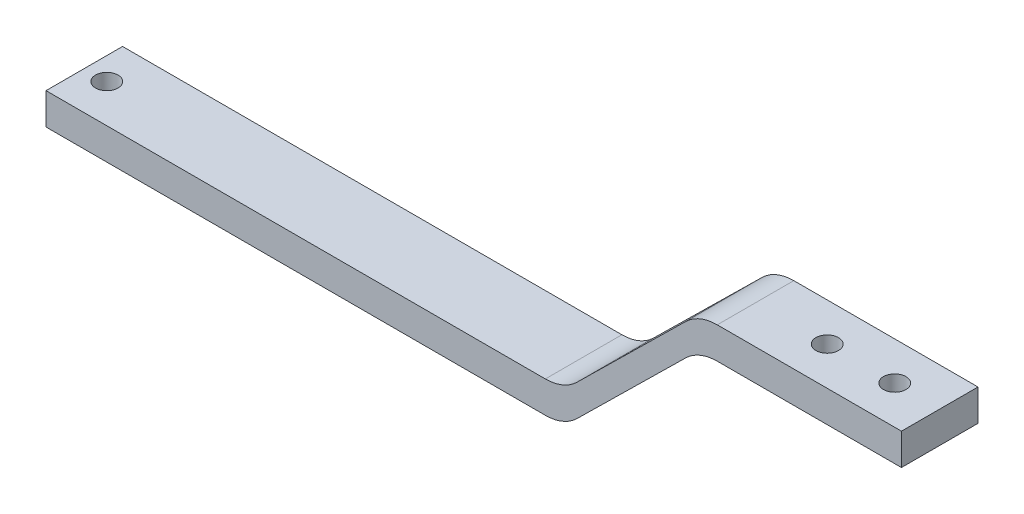
ISO-10303-21;
HEADER;
FILE_DESCRIPTION(('STEP AP214'),'2;1');
FILE_NAME('part.step','',(''),(''),'','','');
FILE_SCHEMA(('AUTOMOTIVE_DESIGN { 1 0 10303 214 1 1 1 1 }'));
ENDSEC;
DATA;
#1=APPLICATION_CONTEXT('core data for automotive mechanical design processes');
#2=APPLICATION_PROTOCOL_DEFINITION('international standard','automotive_design',2000,#1);
#3=PRODUCT_CONTEXT('',#1,'mechanical');
#4=PRODUCT('Part','Part','',(#3));
#5=PRODUCT_RELATED_PRODUCT_CATEGORY('part','',(#4));
#6=PRODUCT_DEFINITION_FORMATION('','',#4);
#7=PRODUCT_DEFINITION_CONTEXT('part definition',#1,'design');
#8=PRODUCT_DEFINITION('design','',#6,#7);
#9=PRODUCT_DEFINITION_SHAPE('','',#8);
#10=(LENGTH_UNIT() NAMED_UNIT(*) SI_UNIT(.MILLI.,.METRE.));
#11=(NAMED_UNIT(*) PLANE_ANGLE_UNIT() SI_UNIT($,.RADIAN.));
#12=(NAMED_UNIT(*) SI_UNIT($,.STERADIAN.) SOLID_ANGLE_UNIT());
#13=UNCERTAINTY_MEASURE_WITH_UNIT(LENGTH_MEASURE(1.E-05),#10,'distance_accuracy_value','');
#14=(GEOMETRIC_REPRESENTATION_CONTEXT(3) GLOBAL_UNCERTAINTY_ASSIGNED_CONTEXT((#13)) GLOBAL_UNIT_ASSIGNED_CONTEXT((#10,
#11,#12)) REPRESENTATION_CONTEXT('',''));
#15=CARTESIAN_POINT('',(0.,0.,0.));
#16=DIRECTION('',(0.,0.,1.));
#17=DIRECTION('',(1.,0.,0.));
#18=AXIS2_PLACEMENT_3D('',#15,#16,#17);
#19=CARTESIAN_POINT('',(-135.932508130997,25.1332184968222,17.));
#20=DIRECTION('',(1.,0.,0.));
#21=DIRECTION('',(0.,0.,-1.));
#22=AXIS2_PLACEMENT_3D('',#19,#20,#21);
#23=PLANE('',#22);
#24=DIRECTION('',(0.,-1.,0.));
#25=VECTOR('',#24,1.);
#26=CARTESIAN_POINT('',(-135.932508130997,25.1332184968222,0.));
#27=LINE('',#26,#25);
#28=CARTESIAN_POINT('',(-135.932508130997,32.1332184968221,0.));
#29=VERTEX_POINT('',#28);
#30=CARTESIAN_POINT('',(-135.932508130997,25.1332184968222,0.));
#31=VERTEX_POINT('',#30);
#32=EDGE_CURVE('E140',#29,#31,#27,.T.);
#33=ORIENTED_EDGE('',*,*,#32,.T.);
#34=DIRECTION('',(0.,0.,-1.));
#35=VECTOR('',#34,1.);
#36=CARTESIAN_POINT('',(-135.932508130997,25.1332184968222,17.));
#37=LINE('',#36,#35);
#38=CARTESIAN_POINT('',(-135.932508130997,25.1332184968222,17.));
#39=VERTEX_POINT('',#38);
#40=EDGE_CURVE('E124',#39,#31,#37,.T.);
#41=ORIENTED_EDGE('',*,*,#40,.F.);
#42=DIRECTION('',(0.,-1.,0.));
#43=VECTOR('',#42,1.);
#44=CARTESIAN_POINT('',(-135.932508130997,25.1332184968222,17.));
#45=LINE('',#44,#43);
#46=CARTESIAN_POINT('',(-135.932508130997,32.1332184968221,17.));
#47=VERTEX_POINT('',#46);
#48=EDGE_CURVE('E128',#47,#39,#45,.T.);
#49=ORIENTED_EDGE('',*,*,#48,.F.);
#50=DIRECTION('',(0.,0.,-1.));
#51=VECTOR('',#50,1.);
#52=CARTESIAN_POINT('',(-135.932508130997,32.1332184968221,17.));
#53=LINE('',#52,#51);
#54=EDGE_CURVE('E209',#47,#29,#53,.T.);
#55=ORIENTED_EDGE('',*,*,#54,.T.);
#56=EDGE_LOOP('',(#33,#41,#49,#55));
#57=FACE_BOUND('',#56,.T.);
#58=ADVANCED_FACE('F31',(#57),#23,.F.);
#59=CARTESIAN_POINT('',(-20.9325081309967,25.1332184968222,17.));
#60=DIRECTION('',(0.,1.,0.));
#61=DIRECTION('',(0.,0.,1.));
#62=AXIS2_PLACEMENT_3D('',#59,#60,#61);
#63=PLANE('',#62);
#64=CARTESIAN_POINT('',(-130.932508130997,25.1332184968222,8.5));
#65=DIRECTION('',(0.,-1.,0.));
#66=DIRECTION('',(0.,0.,-1.));
#67=AXIS2_PLACEMENT_3D('',#64,#65,#66);
#68=CIRCLE('',#67,2.5);
#69=CARTESIAN_POINT('',(-130.932508130997,25.1332184968222,6.00000000000001));
#70=VERTEX_POINT('',#69);
#71=EDGE_CURVE('E195',#70,#70,#68,.T.);
#72=ORIENTED_EDGE('',*,*,#71,.F.);
#73=EDGE_LOOP('',(#72));
#74=FACE_BOUND('',#73,.T.);
#75=DIRECTION('',(1.,0.,0.));
#76=VECTOR('',#75,1.);
#77=CARTESIAN_POINT('',(-20.9325081309967,25.1332184968222,0.));
#78=LINE('',#77,#76);
#79=CARTESIAN_POINT('',(-25.0255043929706,25.1332184968222,0.));
#80=VERTEX_POINT('',#79);
#81=EDGE_CURVE('E211',#31,#80,#78,.T.);
#82=ORIENTED_EDGE('',*,*,#81,.T.);
#83=DIRECTION('',(0.,0.,-1.));
#84=VECTOR('',#83,1.);
#85=CARTESIAN_POINT('',(-25.0255043929706,25.1332184968222,17.));
#86=LINE('',#85,#84);
#87=CARTESIAN_POINT('',(-25.0255043929706,25.1332184968222,17.));
#88=VERTEX_POINT('',#87);
#89=EDGE_CURVE('E54',#80,#88,#86,.F.);
#90=ORIENTED_EDGE('',*,*,#89,.T.);
#91=DIRECTION('',(1.,0.,0.));
#92=VECTOR('',#91,1.);
#93=CARTESIAN_POINT('',(-20.9325081309967,25.1332184968222,17.));
#94=LINE('',#93,#92);
#95=EDGE_CURVE('E120',#39,#88,#94,.T.);
#96=ORIENTED_EDGE('',*,*,#95,.F.);
#97=ORIENTED_EDGE('',*,*,#40,.T.);
#98=EDGE_LOOP('',(#82,#90,#96,#97));
#99=FACE_BOUND('',#98,.T.);
#100=ADVANCED_FACE('F122',(#74,#99),#63,.F.);
#101=CARTESIAN_POINT('',(9.06749186900328,54.6332184968222,17.));
#102=DIRECTION('',(-0.701139951813741,0.713023679810583,0.));
#103=DIRECTION('',(-0.713023679810583,-0.701139951813741,0.));
#104=AXIS2_PLACEMENT_3D('',#101,#102,#103);
#105=PLANE('',#104);
#106=DIRECTION('',(0.713023679810583,0.701139951813741,0.));
#107=VECTOR('',#106,1.);
#108=CARTESIAN_POINT('',(9.06749186900328,54.6332184968222,0.));
#109=LINE('',#108,#107);
#110=CARTESIAN_POINT('',(-18.0141048748332,28.0029816987163,0.));
#111=VERTEX_POINT('',#110);
#112=CARTESIAN_POINT('',(6.14908861283972,51.763455294928,0.));
#113=VERTEX_POINT('',#112);
#114=EDGE_CURVE('E213',#111,#113,#109,.T.);
#115=ORIENTED_EDGE('',*,*,#114,.T.);
#116=DIRECTION('',(0.,0.,-1.));
#117=VECTOR('',#116,1.);
#118=CARTESIAN_POINT('',(6.14908861283972,51.763455294928,17.));
#119=LINE('',#118,#117);
#120=CARTESIAN_POINT('',(6.14908861283972,51.763455294928,17.));
#121=VERTEX_POINT('',#120);
#122=EDGE_CURVE('E154',#113,#121,#119,.F.);
#123=ORIENTED_EDGE('',*,*,#122,.T.);
#124=DIRECTION('',(0.713023679810583,0.701139951813741,0.));
#125=VECTOR('',#124,1.);
#126=CARTESIAN_POINT('',(9.06749186900328,54.6332184968222,17.));
#127=LINE('',#126,#125);
#128=CARTESIAN_POINT('',(-18.0141048748332,28.0029816987163,17.));
#129=VERTEX_POINT('',#128);
#130=EDGE_CURVE('E127',#129,#121,#127,.T.);
#131=ORIENTED_EDGE('',*,*,#130,.F.);
#132=DIRECTION('',(0.,0.,-1.));
#133=VECTOR('',#132,1.);
#134=CARTESIAN_POINT('',(-18.0141048748332,28.0029816987163,17.));
#135=LINE('',#134,#133);
#136=EDGE_CURVE('E145',#129,#111,#135,.T.);
#137=ORIENTED_EDGE('',*,*,#136,.T.);
#138=EDGE_LOOP('',(#115,#123,#131,#137));
#139=FACE_BOUND('',#138,.T.);
#140=ADVANCED_FACE('F261',(#139),#105,.F.);
#141=CARTESIAN_POINT('',(54.0674918690033,54.6332184968222,17.));
#142=DIRECTION('',(0.,1.,0.));
#143=DIRECTION('',(-1.,0.,0.));
#144=AXIS2_PLACEMENT_3D('',#141,#142,#143);
#145=PLANE('',#144);
#146=CARTESIAN_POINT('',(29.0674918690033,54.6332184968222,8.5));
#147=DIRECTION('',(0.,-1.,0.));
#148=DIRECTION('',(1.,0.,0.));
#149=AXIS2_PLACEMENT_3D('',#146,#147,#148);
#150=CIRCLE('',#149,2.49999999999999);
#151=CARTESIAN_POINT('',(31.5674918690033,54.6332184968222,8.5));
#152=VERTEX_POINT('',#151);
#153=EDGE_CURVE('E185',#152,#152,#150,.T.);
#154=ORIENTED_EDGE('',*,*,#153,.F.);
#155=EDGE_LOOP('',(#154));
#156=FACE_BOUND('',#155,.T.);
#157=CARTESIAN_POINT('',(44.0674918690033,54.6332184968222,8.5));
#158=DIRECTION('',(0.,-1.,0.));
#159=DIRECTION('',(1.,0.,0.));
#160=AXIS2_PLACEMENT_3D('',#157,#158,#159);
#161=CIRCLE('',#160,2.5);
#162=CARTESIAN_POINT('',(46.5674918690033,54.6332184968222,8.5));
#163=VERTEX_POINT('',#162);
#164=EDGE_CURVE('E182',#163,#163,#161,.T.);
#165=ORIENTED_EDGE('',*,*,#164,.F.);
#166=EDGE_LOOP('',(#165));
#167=FACE_BOUND('',#166,.T.);
#168=DIRECTION('',(1.,0.,0.));
#169=VECTOR('',#168,1.);
#170=CARTESIAN_POINT('',(54.0674918690033,54.6332184968222,17.));
#171=LINE('',#170,#169);
#172=CARTESIAN_POINT('',(13.1604881309771,54.6332184968222,17.));
#173=VERTEX_POINT('',#172);
#174=CARTESIAN_POINT('',(54.0674918690033,54.6332184968222,17.));
#175=VERTEX_POINT('',#174);
#176=EDGE_CURVE('E200',#173,#175,#171,.T.);
#177=ORIENTED_EDGE('',*,*,#176,.F.);
#178=DIRECTION('',(0.,0.,-1.));
#179=VECTOR('',#178,1.);
#180=CARTESIAN_POINT('',(13.1604881309771,54.6332184968222,0.));
#181=LINE('',#180,#179);
#182=CARTESIAN_POINT('',(13.1604881309771,54.6332184968222,0.));
#183=VERTEX_POINT('',#182);
#184=EDGE_CURVE('E141',#173,#183,#181,.T.);
#185=ORIENTED_EDGE('',*,*,#184,.T.);
#186=DIRECTION('',(1.,0.,0.));
#187=VECTOR('',#186,1.);
#188=CARTESIAN_POINT('',(54.0674918690033,54.6332184968222,0.));
#189=LINE('',#188,#187);
#190=CARTESIAN_POINT('',(54.0674918690033,54.6332184968222,0.));
#191=VERTEX_POINT('',#190);
#192=EDGE_CURVE('E216',#183,#191,#189,.T.);
#193=ORIENTED_EDGE('',*,*,#192,.T.);
#194=DIRECTION('',(0.,0.,-1.));
#195=VECTOR('',#194,1.);
#196=CARTESIAN_POINT('',(54.0674918690033,54.6332184968222,17.));
#197=LINE('',#196,#195);
#198=EDGE_CURVE('E142',#175,#191,#197,.T.);
#199=ORIENTED_EDGE('',*,*,#198,.F.);
#200=EDGE_LOOP('',(#177,#185,#193,#199));
#201=FACE_BOUND('',#200,.T.);
#202=ADVANCED_FACE('F269',(#156,#167,#201),#145,.F.);
#203=CARTESIAN_POINT('',(54.0674918690033,61.6332184968222,17.));
#204=DIRECTION('',(-1.,0.,0.));
#205=DIRECTION('',(0.,0.,1.));
#206=AXIS2_PLACEMENT_3D('',#203,#204,#205);
#207=PLANE('',#206);
#208=DIRECTION('',(0.,1.,0.));
#209=VECTOR('',#208,1.);
#210=CARTESIAN_POINT('',(54.0674918690033,61.6332184968222,0.));
#211=LINE('',#210,#209);
#212=CARTESIAN_POINT('',(54.0674918690033,61.6332184968222,0.));
#213=VERTEX_POINT('',#212);
#214=EDGE_CURVE('E218',#191,#213,#211,.T.);
#215=ORIENTED_EDGE('',*,*,#214,.T.);
#216=DIRECTION('',(0.,0.,-1.));
#217=VECTOR('',#216,1.);
#218=CARTESIAN_POINT('',(54.0674918690033,61.6332184968222,17.));
#219=LINE('',#218,#217);
#220=CARTESIAN_POINT('',(54.0674918690033,61.6332184968222,17.));
#221=VERTEX_POINT('',#220);
#222=EDGE_CURVE('E148',#221,#213,#219,.T.);
#223=ORIENTED_EDGE('',*,*,#222,.F.);
#224=DIRECTION('',(0.,1.,0.));
#225=VECTOR('',#224,1.);
#226=CARTESIAN_POINT('',(54.0674918690033,61.6332184968222,17.));
#227=LINE('',#226,#225);
#228=EDGE_CURVE('E202',#175,#221,#227,.T.);
#229=ORIENTED_EDGE('',*,*,#228,.F.);
#230=ORIENTED_EDGE('',*,*,#198,.T.);
#231=EDGE_LOOP('',(#215,#223,#229,#230));
#232=FACE_BOUND('',#231,.T.);
#233=ADVANCED_FACE('F270',(#232),#207,.F.);
#234=CARTESIAN_POINT('',(9.06749186900329,61.6332184968222,17.));
#235=DIRECTION('',(0.,-1.,0.));
#236=DIRECTION('',(1.,0.,0.));
#237=AXIS2_PLACEMENT_3D('',#234,#235,#236);
#238=PLANE('',#237);
#239=CARTESIAN_POINT('',(29.0674918690033,61.6332184968222,8.5));
#240=DIRECTION('',(0.,-1.,0.));
#241=DIRECTION('',(1.,0.,0.));
#242=AXIS2_PLACEMENT_3D('',#239,#240,#241);
#243=CIRCLE('',#242,2.49999999999999);
#244=CARTESIAN_POINT('',(31.5674918690033,61.6332184968222,8.5));
#245=VERTEX_POINT('',#244);
#246=EDGE_CURVE('E183',#245,#245,#243,.T.);
#247=ORIENTED_EDGE('',*,*,#246,.T.);
#248=EDGE_LOOP('',(#247));
#249=FACE_BOUND('',#248,.T.);
#250=CARTESIAN_POINT('',(44.0674918690033,61.6332184968222,8.5));
#251=DIRECTION('',(0.,-1.,0.));
#252=DIRECTION('',(1.,0.,0.));
#253=AXIS2_PLACEMENT_3D('',#250,#251,#252);
#254=CIRCLE('',#253,2.5);
#255=CARTESIAN_POINT('',(46.5674918690033,61.6332184968222,8.5));
#256=VERTEX_POINT('',#255);
#257=EDGE_CURVE('E180',#256,#256,#254,.T.);
#258=ORIENTED_EDGE('',*,*,#257,.T.);
#259=EDGE_LOOP('',(#258));
#260=FACE_BOUND('',#259,.T.);
#261=DIRECTION('',(-1.,0.,0.));
#262=VECTOR('',#261,1.);
#263=CARTESIAN_POINT('',(9.06749186900329,61.6332184968222,0.));
#264=LINE('',#263,#262);
#265=CARTESIAN_POINT('',(13.1604881309771,61.6332184968222,0.));
#266=VERTEX_POINT('',#265);
#267=EDGE_CURVE('E220',#213,#266,#264,.T.);
#268=ORIENTED_EDGE('',*,*,#267,.T.);
#269=DIRECTION('',(0.,0.,-1.));
#270=VECTOR('',#269,1.);
#271=CARTESIAN_POINT('',(13.1604881309771,61.6332184968222,17.));
#272=LINE('',#271,#270);
#273=CARTESIAN_POINT('',(13.1604881309771,61.6332184968222,17.));
#274=VERTEX_POINT('',#273);
#275=EDGE_CURVE('E165',#266,#274,#272,.F.);
#276=ORIENTED_EDGE('',*,*,#275,.T.);
#277=DIRECTION('',(-1.,0.,0.));
#278=VECTOR('',#277,1.);
#279=CARTESIAN_POINT('',(9.06749186900329,61.6332184968222,17.));
#280=LINE('',#279,#278);
#281=EDGE_CURVE('E204',#221,#274,#280,.T.);
#282=ORIENTED_EDGE('',*,*,#281,.F.);
#283=ORIENTED_EDGE('',*,*,#222,.T.);
#284=EDGE_LOOP('',(#268,#276,#282,#283));
#285=FACE_BOUND('',#284,.T.);
#286=ADVANCED_FACE('F232',(#249,#260,#285),#238,.F.);
#287=CARTESIAN_POINT('',(-20.9325081309967,32.1332184968222,17.));
#288=DIRECTION('',(0.70113995181374,-0.713023679810584,0.));
#289=DIRECTION('',(0.713023679810584,0.70113995181374,0.));
#290=AXIS2_PLACEMENT_3D('',#287,#288,#289);
#291=PLANE('',#290);
#292=DIRECTION('',(-0.713023679810584,-0.70113995181374,0.));
#293=VECTOR('',#292,1.);
#294=CARTESIAN_POINT('',(-20.9325081309967,32.1332184968222,17.));
#295=LINE('',#294,#293);
#296=CARTESIAN_POINT('',(6.14908861283973,58.763455294928,17.));
#297=VERTEX_POINT('',#296);
#298=CARTESIAN_POINT('',(-18.0141048748332,35.0029816987163,17.));
#299=VERTEX_POINT('',#298);
#300=EDGE_CURVE('E206',#297,#299,#295,.T.);
#301=ORIENTED_EDGE('',*,*,#300,.F.);
#302=DIRECTION('',(0.,0.,-1.));
#303=VECTOR('',#302,1.);
#304=CARTESIAN_POINT('',(6.14908861283973,58.763455294928,17.));
#305=LINE('',#304,#303);
#306=CARTESIAN_POINT('',(6.14908861283973,58.763455294928,0.));
#307=VERTEX_POINT('',#306);
#308=EDGE_CURVE('E158',#297,#307,#305,.T.);
#309=ORIENTED_EDGE('',*,*,#308,.T.);
#310=DIRECTION('',(-0.713023679810584,-0.70113995181374,0.));
#311=VECTOR('',#310,1.);
#312=CARTESIAN_POINT('',(-20.9325081309967,32.1332184968222,0.));
#313=LINE('',#312,#311);
#314=CARTESIAN_POINT('',(-18.0141048748332,35.0029816987163,0.));
#315=VERTEX_POINT('',#314);
#316=EDGE_CURVE('E223',#307,#315,#313,.T.);
#317=ORIENTED_EDGE('',*,*,#316,.T.);
#318=DIRECTION('',(0.,0.,-1.));
#319=VECTOR('',#318,1.);
#320=CARTESIAN_POINT('',(-18.0141048748332,35.0029816987163,17.));
#321=LINE('',#320,#319);
#322=EDGE_CURVE('E156',#315,#299,#321,.F.);
#323=ORIENTED_EDGE('',*,*,#322,.T.);
#324=EDGE_LOOP('',(#301,#309,#317,#323));
#325=FACE_BOUND('',#324,.T.);
#326=ADVANCED_FACE('F247',(#325),#291,.F.);
#327=CARTESIAN_POINT('',(-135.932508130997,32.1332184968221,17.));
#328=DIRECTION('',(0.,-1.,0.));
#329=DIRECTION('',(1.,0.,0.));
#330=AXIS2_PLACEMENT_3D('',#327,#328,#329);
#331=PLANE('',#330);
#332=CARTESIAN_POINT('',(-130.932508130997,32.1332184968221,8.5));
#333=DIRECTION('',(0.,-1.,0.));
#334=DIRECTION('',(1.,0.,0.));
#335=AXIS2_PLACEMENT_3D('',#332,#333,#334);
#336=CIRCLE('',#335,2.5);
#337=CARTESIAN_POINT('',(-128.432508130997,32.1332184968221,8.5));
#338=VERTEX_POINT('',#337);
#339=EDGE_CURVE('E35',#338,#338,#336,.T.);
#340=ORIENTED_EDGE('',*,*,#339,.T.);
#341=EDGE_LOOP('',(#340));
#342=FACE_BOUND('',#341,.T.);
#343=DIRECTION('',(-1.,0.,0.));
#344=VECTOR('',#343,1.);
#345=CARTESIAN_POINT('',(-135.932508130997,32.1332184968221,17.));
#346=LINE('',#345,#344);
#347=CARTESIAN_POINT('',(-25.0255043929706,32.1332184968222,17.));
#348=VERTEX_POINT('',#347);
#349=EDGE_CURVE('E133',#348,#47,#346,.T.);
#350=ORIENTED_EDGE('',*,*,#349,.F.);
#351=DIRECTION('',(0.,0.,-1.));
#352=VECTOR('',#351,1.);
#353=CARTESIAN_POINT('',(-25.0255043929706,32.1332184968222,0.));
#354=LINE('',#353,#352);
#355=CARTESIAN_POINT('',(-25.0255043929706,32.1332184968222,0.));
#356=VERTEX_POINT('',#355);
#357=EDGE_CURVE('E172',#348,#356,#354,.T.);
#358=ORIENTED_EDGE('',*,*,#357,.T.);
#359=DIRECTION('',(-1.,0.,0.));
#360=VECTOR('',#359,1.);
#361=CARTESIAN_POINT('',(-135.932508130997,32.1332184968221,0.));
#362=LINE('',#361,#360);
#363=EDGE_CURVE('E137',#356,#29,#362,.T.);
#364=ORIENTED_EDGE('',*,*,#363,.T.);
#365=ORIENTED_EDGE('',*,*,#54,.F.);
#366=EDGE_LOOP('',(#350,#358,#364,#365));
#367=FACE_BOUND('',#366,.T.);
#368=ADVANCED_FACE('F253',(#342,#367),#331,.F.);
#369=CARTESIAN_POINT('',(-135.932508130997,32.1332184968221,17.));
#370=DIRECTION('',(0.,0.,-1.));
#371=DIRECTION('',(-1.,0.,0.));
#372=AXIS2_PLACEMENT_3D('',#369,#370,#371);
#373=PLANE('',#372);
#374=ORIENTED_EDGE('',*,*,#281,.T.);
#375=CARTESIAN_POINT('',(13.1604881309771,51.6332184968222,17.));
#376=DIRECTION('',(0.,0.,-1.));
#377=DIRECTION('',(-1.,0.,0.));
#378=AXIS2_PLACEMENT_3D('',#375,#376,#377);
#379=CIRCLE('',#378,10.);
#380=EDGE_CURVE('E169',#274,#297,#379,.F.);
#381=ORIENTED_EDGE('',*,*,#380,.T.);
#382=ORIENTED_EDGE('',*,*,#300,.T.);
#383=CARTESIAN_POINT('',(-25.0255043929706,42.1332184968222,17.));
#384=DIRECTION('',(0.,0.,-1.));
#385=DIRECTION('',(-1.,0.,0.));
#386=AXIS2_PLACEMENT_3D('',#383,#384,#385);
#387=CIRCLE('',#386,10.);
#388=EDGE_CURVE('E11',#299,#348,#387,.T.);
#389=ORIENTED_EDGE('',*,*,#388,.T.);
#390=ORIENTED_EDGE('',*,*,#349,.T.);
#391=ORIENTED_EDGE('',*,*,#48,.T.);
#392=ORIENTED_EDGE('',*,*,#95,.T.);
#393=CARTESIAN_POINT('',(-25.0255043929706,35.1332184968222,17.));
#394=DIRECTION('',(0.,0.,-1.));
#395=DIRECTION('',(-1.,0.,0.));
#396=AXIS2_PLACEMENT_3D('',#393,#394,#395);
#397=CIRCLE('',#396,10.);
#398=EDGE_CURVE('E167',#88,#129,#397,.F.);
#399=ORIENTED_EDGE('',*,*,#398,.T.);
#400=ORIENTED_EDGE('',*,*,#130,.T.);
#401=CARTESIAN_POINT('',(13.1604881309771,44.6332184968222,17.));
#402=DIRECTION('',(0.,0.,-1.));
#403=DIRECTION('',(-1.,0.,0.));
#404=AXIS2_PLACEMENT_3D('',#401,#402,#403);
#405=CIRCLE('',#404,10.);
#406=EDGE_CURVE('E177',#121,#173,#405,.T.);
#407=ORIENTED_EDGE('',*,*,#406,.T.);
#408=ORIENTED_EDGE('',*,*,#176,.T.);
#409=ORIENTED_EDGE('',*,*,#228,.T.);
#410=EDGE_LOOP('',(#374,#381,#382,#389,#390,#391,#392,#399,#400,#407,#408,#409));
#411=FACE_BOUND('',#410,.T.);
#412=ADVANCED_FACE('F132',(#411),#373,.F.);
#413=CARTESIAN_POINT('',(-135.932508130997,32.1332184968221,0.));
#414=DIRECTION('',(0.,0.,-1.));
#415=DIRECTION('',(-1.,0.,0.));
#416=AXIS2_PLACEMENT_3D('',#413,#414,#415);
#417=PLANE('',#416);
#418=ORIENTED_EDGE('',*,*,#316,.F.);
#419=CARTESIAN_POINT('',(13.1604881309771,51.6332184968222,0.));
#420=DIRECTION('',(0.,0.,-1.));
#421=DIRECTION('',(-1.,0.,0.));
#422=AXIS2_PLACEMENT_3D('',#419,#420,#421);
#423=CIRCLE('',#422,10.);
#424=EDGE_CURVE('E163',#307,#266,#423,.T.);
#425=ORIENTED_EDGE('',*,*,#424,.T.);
#426=ORIENTED_EDGE('',*,*,#267,.F.);
#427=ORIENTED_EDGE('',*,*,#214,.F.);
#428=ORIENTED_EDGE('',*,*,#192,.F.);
#429=CARTESIAN_POINT('',(13.1604881309771,44.6332184968222,0.));
#430=DIRECTION('',(0.,0.,-1.));
#431=DIRECTION('',(-1.,0.,0.));
#432=AXIS2_PLACEMENT_3D('',#429,#430,#431);
#433=CIRCLE('',#432,10.);
#434=EDGE_CURVE('E175',#183,#113,#433,.F.);
#435=ORIENTED_EDGE('',*,*,#434,.T.);
#436=ORIENTED_EDGE('',*,*,#114,.F.);
#437=CARTESIAN_POINT('',(-25.0255043929706,35.1332184968222,0.));
#438=DIRECTION('',(0.,0.,-1.));
#439=DIRECTION('',(-1.,0.,0.));
#440=AXIS2_PLACEMENT_3D('',#437,#438,#439);
#441=CIRCLE('',#440,10.);
#442=EDGE_CURVE('E161',#111,#80,#441,.T.);
#443=ORIENTED_EDGE('',*,*,#442,.T.);
#444=ORIENTED_EDGE('',*,*,#81,.F.);
#445=ORIENTED_EDGE('',*,*,#32,.F.);
#446=ORIENTED_EDGE('',*,*,#363,.F.);
#447=CARTESIAN_POINT('',(-25.0255043929706,42.1332184968222,0.));
#448=DIRECTION('',(0.,0.,-1.));
#449=DIRECTION('',(-1.,0.,0.));
#450=AXIS2_PLACEMENT_3D('',#447,#448,#449);
#451=CIRCLE('',#450,10.);
#452=EDGE_CURVE('E40',#356,#315,#451,.F.);
#453=ORIENTED_EDGE('',*,*,#452,.T.);
#454=EDGE_LOOP('',(#418,#425,#426,#427,#428,#435,#436,#443,#444,#445,#446,#453));
#455=FACE_BOUND('',#454,.T.);
#456=ADVANCED_FACE('F239',(#455),#417,.T.);
#457=CARTESIAN_POINT('',(13.1604881309771,44.6332184968222,17.));
#458=DIRECTION('',(0.,0.,1.));
#459=DIRECTION('',(1.,0.,0.));
#460=AXIS2_PLACEMENT_3D('',#457,#458,#459);
#461=CYLINDRICAL_SURFACE('',#460,10.);
#462=ORIENTED_EDGE('',*,*,#406,.F.);
#463=ORIENTED_EDGE('',*,*,#122,.F.);
#464=ORIENTED_EDGE('',*,*,#434,.F.);
#465=ORIENTED_EDGE('',*,*,#184,.F.);
#466=EDGE_LOOP('',(#462,#463,#464,#465));
#467=FACE_BOUND('',#466,.T.);
#468=ADVANCED_FACE('F264',(#467),#461,.F.);
#469=CARTESIAN_POINT('',(13.1604881309771,51.6332184968222,17.));
#470=DIRECTION('',(0.,0.,-1.));
#471=DIRECTION('',(-1.,0.,0.));
#472=AXIS2_PLACEMENT_3D('',#469,#470,#471);
#473=CYLINDRICAL_SURFACE('',#472,10.);
#474=ORIENTED_EDGE('',*,*,#380,.F.);
#475=ORIENTED_EDGE('',*,*,#275,.F.);
#476=ORIENTED_EDGE('',*,*,#424,.F.);
#477=ORIENTED_EDGE('',*,*,#308,.F.);
#478=EDGE_LOOP('',(#474,#475,#476,#477));
#479=FACE_BOUND('',#478,.T.);
#480=ADVANCED_FACE('F244',(#479),#473,.T.);
#481=CARTESIAN_POINT('',(-25.0255043929706,35.1332184968222,17.));
#482=DIRECTION('',(0.,0.,-1.));
#483=DIRECTION('',(-1.,0.,0.));
#484=AXIS2_PLACEMENT_3D('',#481,#482,#483);
#485=CYLINDRICAL_SURFACE('',#484,10.);
#486=ORIENTED_EDGE('',*,*,#398,.F.);
#487=ORIENTED_EDGE('',*,*,#89,.F.);
#488=ORIENTED_EDGE('',*,*,#442,.F.);
#489=ORIENTED_EDGE('',*,*,#136,.F.);
#490=EDGE_LOOP('',(#486,#487,#488,#489));
#491=FACE_BOUND('',#490,.T.);
#492=ADVANCED_FACE('F256',(#491),#485,.T.);
#493=CARTESIAN_POINT('',(-25.0255043929706,42.1332184968222,17.));
#494=DIRECTION('',(0.,0.,1.));
#495=DIRECTION('',(1.,0.,0.));
#496=AXIS2_PLACEMENT_3D('',#493,#494,#495);
#497=CYLINDRICAL_SURFACE('',#496,10.);
#498=ORIENTED_EDGE('',*,*,#388,.F.);
#499=ORIENTED_EDGE('',*,*,#322,.F.);
#500=ORIENTED_EDGE('',*,*,#452,.F.);
#501=ORIENTED_EDGE('',*,*,#357,.F.);
#502=EDGE_LOOP('',(#498,#499,#500,#501));
#503=FACE_BOUND('',#502,.T.);
#504=ADVANCED_FACE('F33',(#503),#497,.F.);
#505=CARTESIAN_POINT('',(44.0674918690033,71.6332184968222,8.5));
#506=DIRECTION('',(0.,-1.,0.));
#507=DIRECTION('',(1.,0.,0.));
#508=AXIS2_PLACEMENT_3D('',#505,#506,#507);
#509=CYLINDRICAL_SURFACE('',#508,2.5);
#510=ORIENTED_EDGE('',*,*,#164,.T.);
#511=EDGE_LOOP('',(#510));
#512=FACE_BOUND('',#511,.T.);
#513=ORIENTED_EDGE('',*,*,#257,.F.);
#514=EDGE_LOOP('',(#513));
#515=FACE_BOUND('',#514,.T.);
#516=ADVANCED_FACE('F296',(#512,#515),#509,.F.);
#517=CARTESIAN_POINT('',(29.0674918690033,71.6332184968222,8.5));
#518=DIRECTION('',(0.,-1.,0.));
#519=DIRECTION('',(1.,0.,0.));
#520=AXIS2_PLACEMENT_3D('',#517,#518,#519);
#521=CYLINDRICAL_SURFACE('',#520,2.49999999999999);
#522=ORIENTED_EDGE('',*,*,#153,.T.);
#523=EDGE_LOOP('',(#522));
#524=FACE_BOUND('',#523,.T.);
#525=ORIENTED_EDGE('',*,*,#246,.F.);
#526=EDGE_LOOP('',(#525));
#527=FACE_BOUND('',#526,.T.);
#528=ADVANCED_FACE('F300',(#524,#527),#521,.F.);
#529=CARTESIAN_POINT('',(-130.932508130997,42.1332184968222,8.5));
#530=DIRECTION('',(0.,-1.,0.));
#531=DIRECTION('',(0.,0.,-1.));
#532=AXIS2_PLACEMENT_3D('',#529,#530,#531);
#533=CYLINDRICAL_SURFACE('',#532,2.5);
#534=ORIENTED_EDGE('',*,*,#71,.T.);
#535=EDGE_LOOP('',(#534));
#536=FACE_BOUND('',#535,.T.);
#537=ORIENTED_EDGE('',*,*,#339,.F.);
#538=EDGE_LOOP('',(#537));
#539=FACE_BOUND('',#538,.T.);
#540=ADVANCED_FACE('F306',(#536,#539),#533,.F.);
#541=CLOSED_SHELL('',(#58,#100,#140,#202,#233,#286,#326,#368,#412,#456,#468,#480,#492,#504,#516,
#528,#540));
#542=MANIFOLD_SOLID_BREP('B2',#541);
#543=ADVANCED_BREP_SHAPE_REPRESENTATION('',(#18,#542),#14);
#544=SHAPE_DEFINITION_REPRESENTATION(#9,#543);
ENDSEC;
END-ISO-10303-21;
